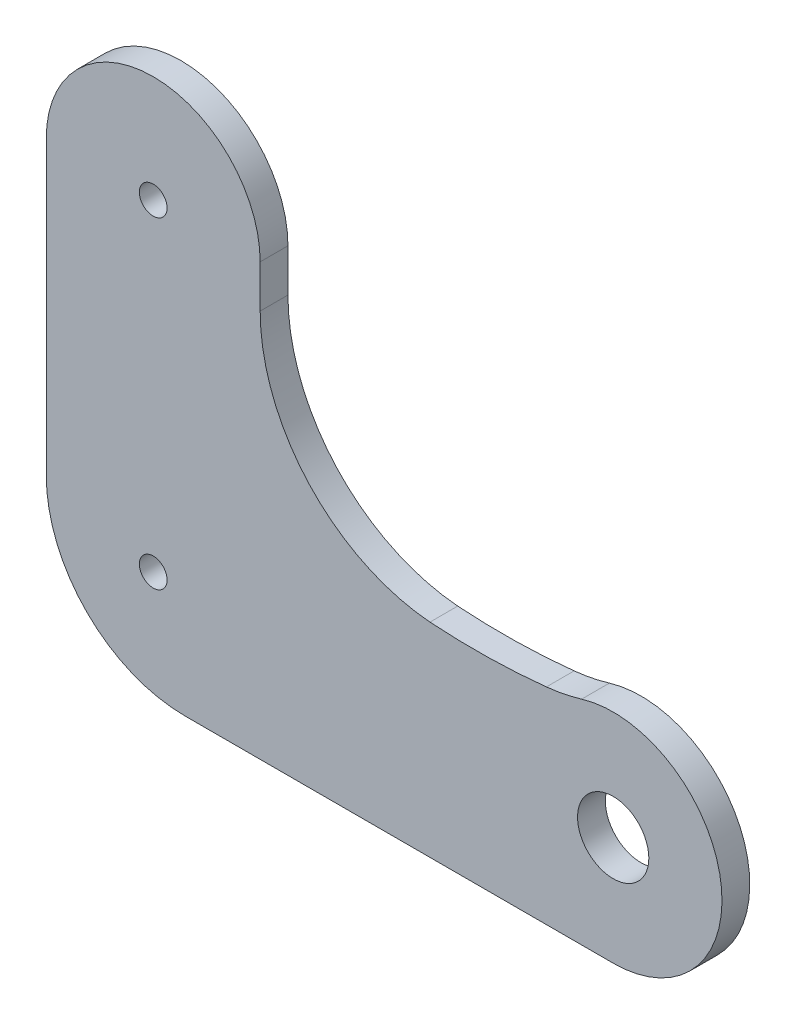
ISO-10303-21;
HEADER;
FILE_DESCRIPTION(('STEP AP214'),'2;1');
FILE_NAME('part.step','',(''),(''),'','','');
FILE_SCHEMA(('AUTOMOTIVE_DESIGN { 1 0 10303 214 1 1 1 1 }'));
ENDSEC;
DATA;
#1=APPLICATION_CONTEXT('core data for automotive mechanical design processes');
#2=APPLICATION_PROTOCOL_DEFINITION('international standard','automotive_design',2000,#1);
#3=PRODUCT_CONTEXT('',#1,'mechanical');
#4=PRODUCT('Part','Part','',(#3));
#5=PRODUCT_RELATED_PRODUCT_CATEGORY('part','',(#4));
#6=PRODUCT_DEFINITION_FORMATION('','',#4);
#7=PRODUCT_DEFINITION_CONTEXT('part definition',#1,'design');
#8=PRODUCT_DEFINITION('design','',#6,#7);
#9=PRODUCT_DEFINITION_SHAPE('','',#8);
#10=(LENGTH_UNIT() NAMED_UNIT(*) SI_UNIT(.MILLI.,.METRE.));
#11=(NAMED_UNIT(*) PLANE_ANGLE_UNIT() SI_UNIT($,.RADIAN.));
#12=(NAMED_UNIT(*) SI_UNIT($,.STERADIAN.) SOLID_ANGLE_UNIT());
#13=UNCERTAINTY_MEASURE_WITH_UNIT(LENGTH_MEASURE(1.E-05),#10,'distance_accuracy_value','');
#14=(GEOMETRIC_REPRESENTATION_CONTEXT(3) GLOBAL_UNCERTAINTY_ASSIGNED_CONTEXT((#13)) GLOBAL_UNIT_ASSIGNED_CONTEXT((#10,
#11,#12)) REPRESENTATION_CONTEXT('',''));
#15=CARTESIAN_POINT('',(0.,0.,0.));
#16=DIRECTION('',(0.,0.,1.));
#17=DIRECTION('',(1.,0.,0.));
#18=AXIS2_PLACEMENT_3D('',#15,#16,#17);
#19=CARTESIAN_POINT('',(27.0230400814508,25.1900794442826,3.));
#20=DIRECTION('',(0.,0.,1.));
#21=DIRECTION('',(1.,0.,0.));
#22=AXIS2_PLACEMENT_3D('',#19,#20,#21);
#23=PLANE('',#22);
#24=CARTESIAN_POINT('',(-4.53251588521748,-5.00153317988371,3.));
#25=DIRECTION('',(0.,0.,1.));
#26=DIRECTION('',(1.,0.,0.));
#27=AXIS2_PLACEMENT_3D('',#24,#25,#26);
#28=CIRCLE('',#27,1.5);
#29=CARTESIAN_POINT('',(-3.03251588521748,-5.00153317988371,3.));
#30=VERTEX_POINT('',#29);
#31=EDGE_CURVE('E312',#30,#30,#28,.T.);
#32=ORIENTED_EDGE('',*,*,#31,.F.);
#33=EDGE_LOOP('',(#32));
#34=FACE_BOUND('',#33,.T.);
#35=CARTESIAN_POINT('',(27.0230400814508,25.1900794442826,3.));
#36=DIRECTION('',(0.,0.,1.));
#37=DIRECTION('',(1.,0.,0.));
#38=AXIS2_PLACEMENT_3D('',#35,#36,#37);
#39=CIRCLE('',#38,20.);
#40=CARTESIAN_POINT('',(7.02304008145076,25.1900788774354,3.));
#41=VERTEX_POINT('',#40);
#42=CARTESIAN_POINT('',(25.3639402343223,5.25901354962313,3.));
#43=VERTEX_POINT('',#42);
#44=EDGE_CURVE('E263',#41,#43,#39,.T.);
#45=ORIENTED_EDGE('',*,*,#44,.F.);
#46=DIRECTION('',(-2.83423447729066E-08,1.,0.));
#47=VECTOR('',#46,1.);
#48=CARTESIAN_POINT('',(7.02304008145076,25.1900788774354,3.));
#49=LINE('',#48,#47);
#50=CARTESIAN_POINT('',(7.02303995092403,29.7954388645846,3.));
#51=VERTEX_POINT('',#50);
#52=EDGE_CURVE('E220',#41,#51,#49,.T.);
#53=ORIENTED_EDGE('',*,*,#52,.T.);
#54=CARTESIAN_POINT('',(-4.53251588521748,29.7954383278406,3.));
#55=DIRECTION('',(0.,0.,1.));
#56=DIRECTION('',(1.,0.,0.));
#57=AXIS2_PLACEMENT_3D('',#54,#55,#56);
#58=CIRCLE('',#57,11.5555558361415);
#59=CARTESIAN_POINT('',(-16.088071721359,29.7954388093689,3.));
#60=VERTEX_POINT('',#59);
#61=EDGE_CURVE('E213',#51,#60,#58,.T.);
#62=ORIENTED_EDGE('',*,*,#61,.T.);
#63=DIRECTION('',(-4.16707154732044E-08,-0.999999999999999,0.));
#64=VECTOR('',#63,1.);
#65=CARTESIAN_POINT('',(-16.088071721359,29.7954388093689,3.));
#66=LINE('',#65,#64);
#67=CARTESIAN_POINT('',(-16.0880721158435,20.3287306873395,3.));
#68=VERTEX_POINT('',#67);
#69=EDGE_CURVE('E218',#60,#68,#66,.T.);
#70=ORIENTED_EDGE('',*,*,#69,.T.);
#71=DIRECTION('',(0.,-1.,0.));
#72=VECTOR('',#71,1.);
#73=CARTESIAN_POINT('',(-16.0880721158435,20.3287306873395,3.));
#74=LINE('',#73,#72);
#75=CARTESIAN_POINT('',(-16.0880721158435,-1.75580714662406,3.));
#76=VERTEX_POINT('',#75);
#77=EDGE_CURVE('E234',#68,#76,#74,.T.);
#78=ORIENTED_EDGE('',*,*,#77,.T.);
#79=CARTESIAN_POINT('',(-1.08807211584348,-1.75580714662416,3.));
#80=DIRECTION('',(0.,0.,1.));
#81=DIRECTION('',(1.,0.,0.));
#82=AXIS2_PLACEMENT_3D('',#79,#80,#81);
#83=CIRCLE('',#82,15.);
#84=CARTESIAN_POINT('',(-1.08807211584338,-16.7558071466242,3.));
#85=VERTEX_POINT('',#84);
#86=EDGE_CURVE('E236',#76,#85,#83,.T.);
#87=ORIENTED_EDGE('',*,*,#86,.T.);
#88=DIRECTION('',(1.,0.,0.));
#89=VECTOR('',#88,1.);
#90=CARTESIAN_POINT('',(-1.08807211584338,-16.7558071466242,3.));
#91=LINE('',#90,#89);
#92=CARTESIAN_POINT('',(45.1627091993307,-16.7558071466242,3.));
#93=VERTEX_POINT('',#92);
#94=EDGE_CURVE('E300',#85,#93,#91,.T.);
#95=ORIENTED_EDGE('',*,*,#94,.T.);
#96=CARTESIAN_POINT('',(45.1627091993307,-5.00153317988371,3.));
#97=DIRECTION('',(0.,0.,1.));
#98=DIRECTION('',(1.,0.,0.));
#99=AXIS2_PLACEMENT_3D('',#96,#97,#98);
#100=CIRCLE('',#99,11.7542739667404);
#101=CARTESIAN_POINT('',(41.7538795170443,6.24759286094076,3.));
#102=VERTEX_POINT('',#101);
#103=EDGE_CURVE('E297',#93,#102,#100,.T.);
#104=ORIENTED_EDGE('',*,*,#103,.T.);
#105=CARTESIAN_POINT('',(35.9537259866211,25.3880792451361,3.));
#106=DIRECTION('',(0.,0.,1.));
#107=DIRECTION('',(1.,0.,0.));
#108=AXIS2_PLACEMENT_3D('',#105,#106,#107);
#109=CIRCLE('',#108,20.0000000000012);
#110=CARTESIAN_POINT('',(37.9456806810149,5.48752356205201,3.));
#111=VERTEX_POINT('',#110);
#112=EDGE_CURVE('E301',#111,#102,#109,.T.);
#113=ORIENTED_EDGE('',*,*,#112,.F.);
#114=CARTESIAN_POINT('',(30.3407781855544,77.7237656329121,3.));
#115=DIRECTION('',(0.,0.,1.));
#116=DIRECTION('',(1.,0.,0.));
#117=AXIS2_PLACEMENT_3D('',#114,#115,#116);
#118=CIRCLE('',#117,72.6354542250914);
#119=EDGE_CURVE('E304',#43,#111,#118,.T.);
#120=ORIENTED_EDGE('',*,*,#119,.F.);
#121=EDGE_LOOP('',(#45,#53,#62,#70,#78,#87,#95,#104,#113,#120));
#122=FACE_BOUND('',#121,.T.);
#123=CARTESIAN_POINT('',(-4.53251588521748,29.7954383278406,3.));
#124=DIRECTION('',(0.,0.,1.));
#125=DIRECTION('',(1.,0.,0.));
#126=AXIS2_PLACEMENT_3D('',#123,#124,#125);
#127=CIRCLE('',#126,1.5);
#128=CARTESIAN_POINT('',(-3.03251588521748,29.7954383278406,3.));
#129=VERTEX_POINT('',#128);
#130=EDGE_CURVE('E245',#129,#129,#127,.T.);
#131=ORIENTED_EDGE('',*,*,#130,.F.);
#132=EDGE_LOOP('',(#131));
#133=FACE_BOUND('',#132,.T.);
#134=CARTESIAN_POINT('',(45.1627091993307,-5.00153317988371,3.));
#135=DIRECTION('',(0.,0.,1.));
#136=DIRECTION('',(1.,0.,0.));
#137=AXIS2_PLACEMENT_3D('',#134,#135,#136);
#138=CIRCLE('',#137,3.85);
#139=CARTESIAN_POINT('',(49.0127091993307,-5.00153317988371,3.));
#140=VERTEX_POINT('',#139);
#141=EDGE_CURVE('E318',#140,#140,#138,.T.);
#142=ORIENTED_EDGE('',*,*,#141,.F.);
#143=EDGE_LOOP('',(#142));
#144=FACE_BOUND('',#143,.T.);
#145=ADVANCED_FACE('F131',(#34,#122,#133,#144),#23,.T.);
#146=CARTESIAN_POINT('',(27.0230400814508,25.1900794442826,0.));
#147=DIRECTION('',(0.,0.,1.));
#148=DIRECTION('',(1.,0.,0.));
#149=AXIS2_PLACEMENT_3D('',#146,#147,#148);
#150=PLANE('',#149);
#151=CARTESIAN_POINT('',(27.0230400814508,25.1900794442826,0.));
#152=DIRECTION('',(0.,0.,1.));
#153=DIRECTION('',(1.,0.,0.));
#154=AXIS2_PLACEMENT_3D('',#151,#152,#153);
#155=CIRCLE('',#154,20.);
#156=CARTESIAN_POINT('',(7.02304008145076,25.1900788774354,0.));
#157=VERTEX_POINT('',#156);
#158=CARTESIAN_POINT('',(25.3639402343223,5.25901354962313,0.));
#159=VERTEX_POINT('',#158);
#160=EDGE_CURVE('E241',#157,#159,#155,.T.);
#161=ORIENTED_EDGE('',*,*,#160,.T.);
#162=CARTESIAN_POINT('',(30.3407781855544,77.7237656329121,0.));
#163=DIRECTION('',(0.,0.,1.));
#164=DIRECTION('',(1.,0.,0.));
#165=AXIS2_PLACEMENT_3D('',#162,#163,#164);
#166=CIRCLE('',#165,72.6354542250914);
#167=CARTESIAN_POINT('',(37.9456806810149,5.48752356205201,0.));
#168=VERTEX_POINT('',#167);
#169=EDGE_CURVE('E244',#159,#168,#166,.T.);
#170=ORIENTED_EDGE('',*,*,#169,.T.);
#171=CARTESIAN_POINT('',(35.9537259866211,25.3880792451361,0.));
#172=DIRECTION('',(0.,0.,1.));
#173=DIRECTION('',(1.,0.,0.));
#174=AXIS2_PLACEMENT_3D('',#171,#172,#173);
#175=CIRCLE('',#174,20.0000000000012);
#176=CARTESIAN_POINT('',(41.7538795170443,6.24759286094076,0.));
#177=VERTEX_POINT('',#176);
#178=EDGE_CURVE('E248',#168,#177,#175,.T.);
#179=ORIENTED_EDGE('',*,*,#178,.T.);
#180=CARTESIAN_POINT('',(45.1627091993307,-5.00153317988371,0.));
#181=DIRECTION('',(0.,0.,1.));
#182=DIRECTION('',(1.,0.,0.));
#183=AXIS2_PLACEMENT_3D('',#180,#181,#182);
#184=CIRCLE('',#183,11.7542739667404);
#185=CARTESIAN_POINT('',(45.1627091993307,-16.7558071466242,0.));
#186=VERTEX_POINT('',#185);
#187=EDGE_CURVE('E251',#186,#177,#184,.T.);
#188=ORIENTED_EDGE('',*,*,#187,.F.);
#189=DIRECTION('',(1.,0.,0.));
#190=VECTOR('',#189,1.);
#191=CARTESIAN_POINT('',(-1.08807211584338,-16.7558071466242,0.));
#192=LINE('',#191,#190);
#193=CARTESIAN_POINT('',(-1.08807211584338,-16.7558071466242,0.));
#194=VERTEX_POINT('',#193);
#195=EDGE_CURVE('E254',#194,#186,#192,.T.);
#196=ORIENTED_EDGE('',*,*,#195,.F.);
#197=CARTESIAN_POINT('',(-1.08807211584348,-1.75580714662416,0.));
#198=DIRECTION('',(0.,0.,1.));
#199=DIRECTION('',(1.,0.,0.));
#200=AXIS2_PLACEMENT_3D('',#197,#198,#199);
#201=CIRCLE('',#200,15.);
#202=CARTESIAN_POINT('',(-16.0880721158435,-1.75580714662406,0.));
#203=VERTEX_POINT('',#202);
#204=EDGE_CURVE('E256',#203,#194,#201,.T.);
#205=ORIENTED_EDGE('',*,*,#204,.F.);
#206=DIRECTION('',(0.,-1.,0.));
#207=VECTOR('',#206,1.);
#208=CARTESIAN_POINT('',(-16.0880721158435,20.3287306873395,0.));
#209=LINE('',#208,#207);
#210=CARTESIAN_POINT('',(-16.0880721158435,20.3287306873395,0.));
#211=VERTEX_POINT('',#210);
#212=EDGE_CURVE('E258',#211,#203,#209,.T.);
#213=ORIENTED_EDGE('',*,*,#212,.F.);
#214=DIRECTION('',(-4.16707154732044E-08,-0.999999999999999,0.));
#215=VECTOR('',#214,1.);
#216=CARTESIAN_POINT('',(-16.088071721359,29.7954388093689,0.));
#217=LINE('',#216,#215);
#218=CARTESIAN_POINT('',(-16.088071721359,29.7954388093689,0.));
#219=VERTEX_POINT('',#218);
#220=EDGE_CURVE('E260',#219,#211,#217,.T.);
#221=ORIENTED_EDGE('',*,*,#220,.F.);
#222=CARTESIAN_POINT('',(-4.53251588521748,29.7954383278406,0.));
#223=DIRECTION('',(0.,0.,1.));
#224=DIRECTION('',(1.,0.,0.));
#225=AXIS2_PLACEMENT_3D('',#222,#223,#224);
#226=CIRCLE('',#225,11.5555558361415);
#227=CARTESIAN_POINT('',(7.02303995092403,29.7954388645846,0.));
#228=VERTEX_POINT('',#227);
#229=EDGE_CURVE('E227',#228,#219,#226,.T.);
#230=ORIENTED_EDGE('',*,*,#229,.F.);
#231=DIRECTION('',(-2.83423447729066E-08,1.,0.));
#232=VECTOR('',#231,1.);
#233=CARTESIAN_POINT('',(7.02304008145076,25.1900788774354,0.));
#234=LINE('',#233,#232);
#235=EDGE_CURVE('E183',#157,#228,#234,.T.);
#236=ORIENTED_EDGE('',*,*,#235,.F.);
#237=EDGE_LOOP('',(#161,#170,#179,#188,#196,#205,#213,#221,#230,#236));
#238=FACE_BOUND('',#237,.T.);
#239=CARTESIAN_POINT('',(-4.53251588521748,29.7954383278406,0.));
#240=DIRECTION('',(0.,0.,1.));
#241=DIRECTION('',(1.,0.,0.));
#242=AXIS2_PLACEMENT_3D('',#239,#240,#241);
#243=CIRCLE('',#242,1.5);
#244=CARTESIAN_POINT('',(-3.03251588521748,29.7954383278406,0.));
#245=VERTEX_POINT('',#244);
#246=EDGE_CURVE('E309',#245,#245,#243,.T.);
#247=ORIENTED_EDGE('',*,*,#246,.T.);
#248=EDGE_LOOP('',(#247));
#249=FACE_BOUND('',#248,.T.);
#250=CARTESIAN_POINT('',(-4.53251588521748,-5.00153317988371,0.));
#251=DIRECTION('',(0.,0.,1.));
#252=DIRECTION('',(1.,0.,0.));
#253=AXIS2_PLACEMENT_3D('',#250,#251,#252);
#254=CIRCLE('',#253,1.5);
#255=CARTESIAN_POINT('',(-3.03251588521748,-5.00153317988371,0.));
#256=VERTEX_POINT('',#255);
#257=EDGE_CURVE('E315',#256,#256,#254,.T.);
#258=ORIENTED_EDGE('',*,*,#257,.T.);
#259=EDGE_LOOP('',(#258));
#260=FACE_BOUND('',#259,.T.);
#261=CARTESIAN_POINT('',(45.1627091993307,-5.00153317988371,0.));
#262=DIRECTION('',(0.,0.,1.));
#263=DIRECTION('',(1.,0.,0.));
#264=AXIS2_PLACEMENT_3D('',#261,#262,#263);
#265=CIRCLE('',#264,3.85);
#266=CARTESIAN_POINT('',(49.0127091993307,-5.00153317988371,0.));
#267=VERTEX_POINT('',#266);
#268=EDGE_CURVE('E321',#267,#267,#265,.T.);
#269=ORIENTED_EDGE('',*,*,#268,.T.);
#270=EDGE_LOOP('',(#269));
#271=FACE_BOUND('',#270,.T.);
#272=ADVANCED_FACE('F279',(#238,#249,#260,#271),#150,.F.);
#273=CARTESIAN_POINT('',(27.0230400814508,25.1900794442826,3.));
#274=DIRECTION('',(0.,0.,-1.));
#275=DIRECTION('',(-1.,0.,0.));
#276=AXIS2_PLACEMENT_3D('',#273,#274,#275);
#277=CYLINDRICAL_SURFACE('',#276,20.);
#278=ORIENTED_EDGE('',*,*,#160,.F.);
#279=DIRECTION('',(0.,0.,-1.));
#280=VECTOR('',#279,1.);
#281=CARTESIAN_POINT('',(7.02304008145076,25.1900788774354,3.));
#282=LINE('',#281,#280);
#283=EDGE_CURVE('E12',#41,#157,#282,.T.);
#284=ORIENTED_EDGE('',*,*,#283,.F.);
#285=ORIENTED_EDGE('',*,*,#44,.T.);
#286=DIRECTION('',(0.,0.,-1.));
#287=VECTOR('',#286,1.);
#288=CARTESIAN_POINT('',(25.3639402343223,5.25901354962313,3.));
#289=LINE('',#288,#287);
#290=EDGE_CURVE('E135',#43,#159,#289,.T.);
#291=ORIENTED_EDGE('',*,*,#290,.T.);
#292=EDGE_LOOP('',(#278,#284,#285,#291));
#293=FACE_BOUND('',#292,.T.);
#294=ADVANCED_FACE('F133',(#293),#277,.F.);
#295=CARTESIAN_POINT('',(7.02304008145076,25.1900788774354,3.));
#296=DIRECTION('',(-1.,-2.83423447729066E-08,0.));
#297=DIRECTION('',(2.83423447729066E-08,-1.,0.));
#298=AXIS2_PLACEMENT_3D('',#295,#296,#297);
#299=PLANE('',#298);
#300=ORIENTED_EDGE('',*,*,#235,.T.);
#301=DIRECTION('',(0.,0.,-1.));
#302=VECTOR('',#301,1.);
#303=CARTESIAN_POINT('',(7.02303995092403,29.7954388645846,3.));
#304=LINE('',#303,#302);
#305=EDGE_CURVE('E141',#51,#228,#304,.T.);
#306=ORIENTED_EDGE('',*,*,#305,.F.);
#307=ORIENTED_EDGE('',*,*,#52,.F.);
#308=ORIENTED_EDGE('',*,*,#283,.T.);
#309=EDGE_LOOP('',(#300,#306,#307,#308));
#310=FACE_BOUND('',#309,.T.);
#311=ADVANCED_FACE('F342',(#310),#299,.F.);
#312=CARTESIAN_POINT('',(-4.53251588521748,29.7954383278406,3.));
#313=DIRECTION('',(0.,0.,-1.));
#314=DIRECTION('',(-1.,0.,0.));
#315=AXIS2_PLACEMENT_3D('',#312,#313,#314);
#316=CYLINDRICAL_SURFACE('',#315,11.5555558361415);
#317=ORIENTED_EDGE('',*,*,#229,.T.);
#318=DIRECTION('',(0.,0.,-1.));
#319=VECTOR('',#318,1.);
#320=CARTESIAN_POINT('',(-16.088071721359,29.7954388093689,3.));
#321=LINE('',#320,#319);
#322=EDGE_CURVE('E224',#60,#219,#321,.T.);
#323=ORIENTED_EDGE('',*,*,#322,.F.);
#324=ORIENTED_EDGE('',*,*,#61,.F.);
#325=ORIENTED_EDGE('',*,*,#305,.T.);
#326=EDGE_LOOP('',(#317,#323,#324,#325));
#327=FACE_BOUND('',#326,.T.);
#328=ADVANCED_FACE('F225',(#327),#316,.T.);
#329=CARTESIAN_POINT('',(-16.088071721359,29.7954388093689,3.));
#330=DIRECTION('',(0.999999999999999,-4.16707154732044E-08,0.));
#331=DIRECTION('',(4.16707154732044E-08,0.999999999999999,0.));
#332=AXIS2_PLACEMENT_3D('',#329,#330,#331);
#333=PLANE('',#332);
#334=ORIENTED_EDGE('',*,*,#220,.T.);
#335=ORIENTED_EDGE('',*,*,#212,.T.);
#336=DIRECTION('',(0.,0.,-1.));
#337=VECTOR('',#336,1.);
#338=CARTESIAN_POINT('',(-16.0880721158435,-1.75580714662406,3.));
#339=LINE('',#338,#337);
#340=EDGE_CURVE('E230',#76,#203,#339,.T.);
#341=ORIENTED_EDGE('',*,*,#340,.F.);
#342=ORIENTED_EDGE('',*,*,#77,.F.);
#343=ORIENTED_EDGE('',*,*,#69,.F.);
#344=ORIENTED_EDGE('',*,*,#322,.T.);
#345=EDGE_LOOP('',(#334,#335,#341,#342,#343,#344));
#346=FACE_BOUND('',#345,.T.);
#347=ADVANCED_FACE('F232',(#346),#333,.F.);
#348=CARTESIAN_POINT('',(-1.08807211584348,-1.75580714662416,3.));
#349=DIRECTION('',(0.,0.,-1.));
#350=DIRECTION('',(-1.,0.,0.));
#351=AXIS2_PLACEMENT_3D('',#348,#349,#350);
#352=CYLINDRICAL_SURFACE('',#351,15.);
#353=ORIENTED_EDGE('',*,*,#204,.T.);
#354=DIRECTION('',(0.,0.,-1.));
#355=VECTOR('',#354,1.);
#356=CARTESIAN_POINT('',(-1.08807211584338,-16.7558071466242,3.));
#357=LINE('',#356,#355);
#358=EDGE_CURVE('E268',#85,#194,#357,.T.);
#359=ORIENTED_EDGE('',*,*,#358,.F.);
#360=ORIENTED_EDGE('',*,*,#86,.F.);
#361=ORIENTED_EDGE('',*,*,#340,.T.);
#362=EDGE_LOOP('',(#353,#359,#360,#361));
#363=FACE_BOUND('',#362,.T.);
#364=ADVANCED_FACE('F285',(#363),#352,.T.);
#365=CARTESIAN_POINT('',(-1.08807211584338,-16.7558071466242,3.));
#366=DIRECTION('',(0.,1.,0.));
#367=DIRECTION('',(0.,0.,1.));
#368=AXIS2_PLACEMENT_3D('',#365,#366,#367);
#369=PLANE('',#368);
#370=ORIENTED_EDGE('',*,*,#195,.T.);
#371=DIRECTION('',(0.,0.,-1.));
#372=VECTOR('',#371,1.);
#373=CARTESIAN_POINT('',(45.1627091993307,-16.7558071466242,3.));
#374=LINE('',#373,#372);
#375=EDGE_CURVE('E271',#93,#186,#374,.T.);
#376=ORIENTED_EDGE('',*,*,#375,.F.);
#377=ORIENTED_EDGE('',*,*,#94,.F.);
#378=ORIENTED_EDGE('',*,*,#358,.T.);
#379=EDGE_LOOP('',(#370,#376,#377,#378));
#380=FACE_BOUND('',#379,.T.);
#381=ADVANCED_FACE('F291',(#380),#369,.F.);
#382=CARTESIAN_POINT('',(45.1627091993307,-5.00153317988371,3.));
#383=DIRECTION('',(0.,0.,-1.));
#384=DIRECTION('',(-1.,0.,0.));
#385=AXIS2_PLACEMENT_3D('',#382,#383,#384);
#386=CYLINDRICAL_SURFACE('',#385,11.7542739667404);
#387=ORIENTED_EDGE('',*,*,#187,.T.);
#388=DIRECTION('',(0.,0.,-1.));
#389=VECTOR('',#388,1.);
#390=CARTESIAN_POINT('',(41.7538795170443,6.24759286094076,3.));
#391=LINE('',#390,#389);
#392=EDGE_CURVE('E274',#102,#177,#391,.T.);
#393=ORIENTED_EDGE('',*,*,#392,.F.);
#394=ORIENTED_EDGE('',*,*,#103,.F.);
#395=ORIENTED_EDGE('',*,*,#375,.T.);
#396=EDGE_LOOP('',(#387,#393,#394,#395));
#397=FACE_BOUND('',#396,.T.);
#398=ADVANCED_FACE('F295',(#397),#386,.T.);
#399=CARTESIAN_POINT('',(35.9537259866211,25.3880792451361,3.));
#400=DIRECTION('',(0.,0.,-1.));
#401=DIRECTION('',(-1.,0.,0.));
#402=AXIS2_PLACEMENT_3D('',#399,#400,#401);
#403=CYLINDRICAL_SURFACE('',#402,20.0000000000012);
#404=ORIENTED_EDGE('',*,*,#178,.F.);
#405=DIRECTION('',(0.,0.,-1.));
#406=VECTOR('',#405,1.);
#407=CARTESIAN_POINT('',(37.9456806810149,5.48752356205201,3.));
#408=LINE('',#407,#406);
#409=EDGE_CURVE('E275',#111,#168,#408,.T.);
#410=ORIENTED_EDGE('',*,*,#409,.F.);
#411=ORIENTED_EDGE('',*,*,#112,.T.);
#412=ORIENTED_EDGE('',*,*,#392,.T.);
#413=EDGE_LOOP('',(#404,#410,#411,#412));
#414=FACE_BOUND('',#413,.T.);
#415=ADVANCED_FACE('F355',(#414),#403,.F.);
#416=CARTESIAN_POINT('',(30.3407781855544,77.7237656329121,3.));
#417=DIRECTION('',(0.,0.,-1.));
#418=DIRECTION('',(-1.,0.,0.));
#419=AXIS2_PLACEMENT_3D('',#416,#417,#418);
#420=CYLINDRICAL_SURFACE('',#419,72.6354542250914);
#421=ORIENTED_EDGE('',*,*,#169,.F.);
#422=ORIENTED_EDGE('',*,*,#290,.F.);
#423=ORIENTED_EDGE('',*,*,#119,.T.);
#424=ORIENTED_EDGE('',*,*,#409,.T.);
#425=EDGE_LOOP('',(#421,#422,#423,#424));
#426=FACE_BOUND('',#425,.T.);
#427=ADVANCED_FACE('F277',(#426),#420,.F.);
#428=CARTESIAN_POINT('',(-4.53251588521748,29.7954383278406,3.));
#429=DIRECTION('',(0.,0.,-1.));
#430=DIRECTION('',(-1.,0.,0.));
#431=AXIS2_PLACEMENT_3D('',#428,#429,#430);
#432=CYLINDRICAL_SURFACE('',#431,1.5);
#433=ORIENTED_EDGE('',*,*,#130,.T.);
#434=EDGE_LOOP('',(#433));
#435=FACE_BOUND('',#434,.T.);
#436=ORIENTED_EDGE('',*,*,#246,.F.);
#437=EDGE_LOOP('',(#436));
#438=FACE_BOUND('',#437,.T.);
#439=ADVANCED_FACE('F339',(#435,#438),#432,.F.);
#440=CARTESIAN_POINT('',(-4.53251588521748,-5.00153317988371,3.));
#441=DIRECTION('',(0.,0.,-1.));
#442=DIRECTION('',(-1.,0.,0.));
#443=AXIS2_PLACEMENT_3D('',#440,#441,#442);
#444=CYLINDRICAL_SURFACE('',#443,1.5);
#445=ORIENTED_EDGE('',*,*,#31,.T.);
#446=EDGE_LOOP('',(#445));
#447=FACE_BOUND('',#446,.T.);
#448=ORIENTED_EDGE('',*,*,#257,.F.);
#449=EDGE_LOOP('',(#448));
#450=FACE_BOUND('',#449,.T.);
#451=ADVANCED_FACE('F362',(#447,#450),#444,.F.);
#452=CARTESIAN_POINT('',(45.1627091993307,-5.00153317988371,3.));
#453=DIRECTION('',(0.,0.,-1.));
#454=DIRECTION('',(-1.,0.,0.));
#455=AXIS2_PLACEMENT_3D('',#452,#453,#454);
#456=CYLINDRICAL_SURFACE('',#455,3.85);
#457=ORIENTED_EDGE('',*,*,#141,.T.);
#458=EDGE_LOOP('',(#457));
#459=FACE_BOUND('',#458,.T.);
#460=ORIENTED_EDGE('',*,*,#268,.F.);
#461=EDGE_LOOP('',(#460));
#462=FACE_BOUND('',#461,.T.);
#463=ADVANCED_FACE('F327',(#459,#462),#456,.F.);
#464=CLOSED_SHELL('',(#145,#272,#294,#311,#328,#347,#364,#381,#398,#415,#427,#439,#451,#463));
#465=MANIFOLD_SOLID_BREP('B2',#464);
#466=ADVANCED_BREP_SHAPE_REPRESENTATION('',(#18,#465),#14);
#467=SHAPE_DEFINITION_REPRESENTATION(#9,#466);
ENDSEC;
END-ISO-10303-21;
